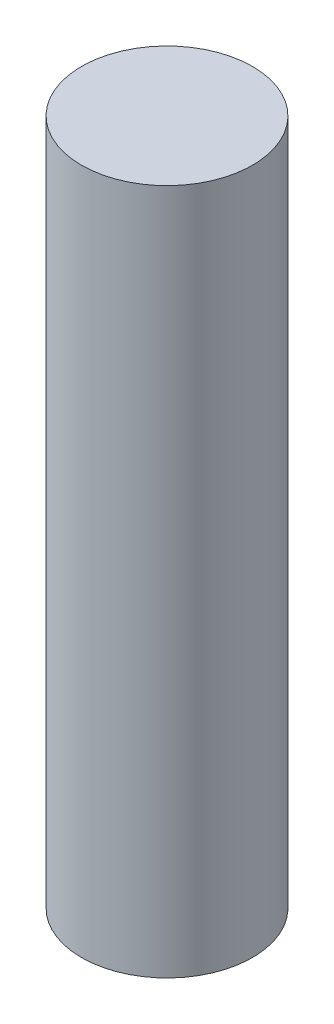
ISO-10303-21;
HEADER;
FILE_DESCRIPTION(('STEP AP214'),'2;1');
FILE_NAME('part.step','',(''),(''),'','','');
FILE_SCHEMA(('AUTOMOTIVE_DESIGN { 1 0 10303 214 1 1 1 1 }'));
ENDSEC;
DATA;
#1=APPLICATION_CONTEXT('core data for automotive mechanical design processes');
#2=APPLICATION_PROTOCOL_DEFINITION('international standard','automotive_design',2000,#1);
#3=PRODUCT_CONTEXT('',#1,'mechanical');
#4=PRODUCT('Part','Part','',(#3));
#5=PRODUCT_RELATED_PRODUCT_CATEGORY('part','',(#4));
#6=PRODUCT_DEFINITION_FORMATION('','',#4);
#7=PRODUCT_DEFINITION_CONTEXT('part definition',#1,'design');
#8=PRODUCT_DEFINITION('design','',#6,#7);
#9=PRODUCT_DEFINITION_SHAPE('','',#8);
#10=(LENGTH_UNIT() NAMED_UNIT(*) SI_UNIT(.MILLI.,.METRE.));
#11=(NAMED_UNIT(*) PLANE_ANGLE_UNIT() SI_UNIT($,.RADIAN.));
#12=(NAMED_UNIT(*) SI_UNIT($,.STERADIAN.) SOLID_ANGLE_UNIT());
#13=UNCERTAINTY_MEASURE_WITH_UNIT(LENGTH_MEASURE(1.E-05),#10,'distance_accuracy_value','');
#14=(GEOMETRIC_REPRESENTATION_CONTEXT(3) GLOBAL_UNCERTAINTY_ASSIGNED_CONTEXT((#13)) GLOBAL_UNIT_ASSIGNED_CONTEXT((#10,
#11,#12)) REPRESENTATION_CONTEXT('',''));
#15=CARTESIAN_POINT('',(0.,0.,0.));
#16=DIRECTION('',(0.,0.,1.));
#17=DIRECTION('',(1.,0.,0.));
#18=AXIS2_PLACEMENT_3D('',#15,#16,#17);
#19=CARTESIAN_POINT('',(0.,19.05,0.));
#20=DIRECTION('',(0.,-1.,0.));
#21=DIRECTION('',(0.,0.,-1.00000000000001));
#22=AXIS2_PLACEMENT_3D('',#19,#20,#21);
#23=CYLINDRICAL_SURFACE('',#22,2.3749);
#24=CARTESIAN_POINT('',(0.,19.05,0.));
#25=DIRECTION('',(0.,1.,0.));
#26=DIRECTION('',(0.,0.,1.00000000000001));
#27=AXIS2_PLACEMENT_3D('',#24,#25,#26);
#28=CIRCLE('',#27,2.3749);
#29=CARTESIAN_POINT('',(0.,19.05,2.37490000000003));
#30=VERTEX_POINT('',#29);
#31=EDGE_CURVE('E10',#30,#30,#28,.T.);
#32=ORIENTED_EDGE('',*,*,#31,.F.);
#33=EDGE_LOOP('',(#32));
#34=FACE_BOUND('',#33,.T.);
#35=CARTESIAN_POINT('',(0.,0.,0.));
#36=DIRECTION('',(0.,1.,0.));
#37=DIRECTION('',(0.,0.,1.00000000000001));
#38=AXIS2_PLACEMENT_3D('',#35,#36,#37);
#39=CIRCLE('',#38,2.3749);
#40=CARTESIAN_POINT('',(0.,0.,2.37490000000003));
#41=VERTEX_POINT('',#40);
#42=EDGE_CURVE('E37',#41,#41,#39,.T.);
#43=ORIENTED_EDGE('',*,*,#42,.T.);
#44=EDGE_LOOP('',(#43));
#45=FACE_BOUND('',#44,.T.);
#46=ADVANCED_FACE('F34',(#34,#45),#23,.T.);
#47=CARTESIAN_POINT('',(0.,19.05,0.));
#48=DIRECTION('',(0.,1.,0.));
#49=DIRECTION('',(0.,0.,1.00000000000001));
#50=AXIS2_PLACEMENT_3D('',#47,#48,#49);
#51=PLANE('',#50);
#52=ORIENTED_EDGE('',*,*,#31,.T.);
#53=EDGE_LOOP('',(#52));
#54=FACE_BOUND('',#53,.T.);
#55=ADVANCED_FACE('F53',(#54),#51,.T.);
#56=CARTESIAN_POINT('',(0.,0.,0.));
#57=DIRECTION('',(0.,1.,0.));
#58=DIRECTION('',(0.,0.,1.00000000000001));
#59=AXIS2_PLACEMENT_3D('',#56,#57,#58);
#60=PLANE('',#59);
#61=ORIENTED_EDGE('',*,*,#42,.F.);
#62=EDGE_LOOP('',(#61));
#63=FACE_BOUND('',#62,.T.);
#64=ADVANCED_FACE('F51',(#63),#60,.F.);
#65=CLOSED_SHELL('',(#46,#55,#64));
#66=MANIFOLD_SOLID_BREP('B2',#65);
#67=ADVANCED_BREP_SHAPE_REPRESENTATION('',(#18,#66),#14);
#68=SHAPE_DEFINITION_REPRESENTATION(#9,#67);
ENDSEC;
END-ISO-10303-21;
